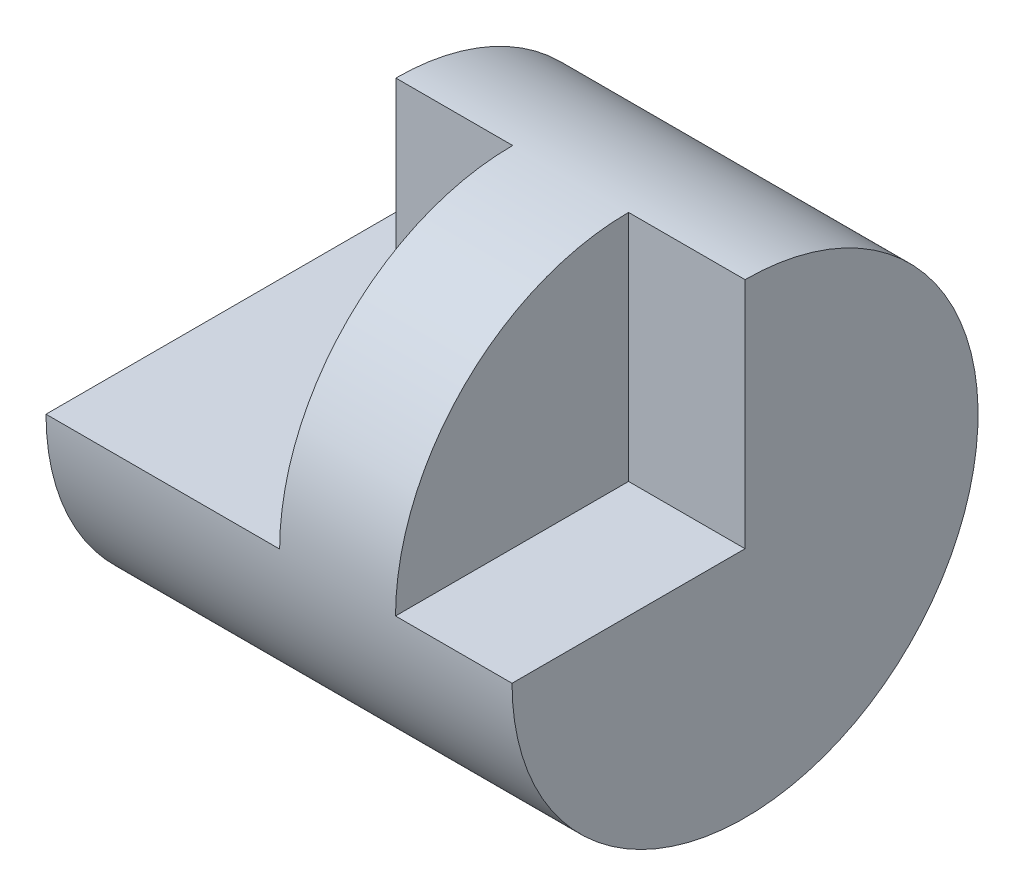
ISO-10303-21;
HEADER;
FILE_DESCRIPTION(('STEP AP214'),'2;1');
FILE_NAME('part.step','',(''),(''),'','','');
FILE_SCHEMA(('AUTOMOTIVE_DESIGN { 1 0 10303 214 1 1 1 1 }'));
ENDSEC;
DATA;
#1=APPLICATION_CONTEXT('core data for automotive mechanical design processes');
#2=APPLICATION_PROTOCOL_DEFINITION('international standard','automotive_design',2000,#1);
#3=PRODUCT_CONTEXT('',#1,'mechanical');
#4=PRODUCT('Part','Part','',(#3));
#5=PRODUCT_RELATED_PRODUCT_CATEGORY('part','',(#4));
#6=PRODUCT_DEFINITION_FORMATION('','',#4);
#7=PRODUCT_DEFINITION_CONTEXT('part definition',#1,'design');
#8=PRODUCT_DEFINITION('design','',#6,#7);
#9=PRODUCT_DEFINITION_SHAPE('','',#8);
#10=(LENGTH_UNIT() NAMED_UNIT(*) SI_UNIT(.MILLI.,.METRE.));
#11=(NAMED_UNIT(*) PLANE_ANGLE_UNIT() SI_UNIT($,.RADIAN.));
#12=(NAMED_UNIT(*) SI_UNIT($,.STERADIAN.) SOLID_ANGLE_UNIT());
#13=UNCERTAINTY_MEASURE_WITH_UNIT(LENGTH_MEASURE(1.E-05),#10,'distance_accuracy_value','');
#14=(GEOMETRIC_REPRESENTATION_CONTEXT(3) GLOBAL_UNCERTAINTY_ASSIGNED_CONTEXT((#13)) GLOBAL_UNIT_ASSIGNED_CONTEXT((#10,
#11,#12)) REPRESENTATION_CONTEXT('',''));
#15=CARTESIAN_POINT('',(0.,0.,0.));
#16=DIRECTION('',(0.,0.,1.));
#17=DIRECTION('',(1.,0.,0.));
#18=AXIS2_PLACEMENT_3D('',#15,#16,#17);
#19=CARTESIAN_POINT('',(0.,0.,0.));
#20=DIRECTION('',(-1.,0.,0.));
#21=DIRECTION('',(0.,0.,1.));
#22=AXIS2_PLACEMENT_3D('',#19,#20,#21);
#23=CYLINDRICAL_SURFACE('',#22,2.);
#24=CARTESIAN_POINT('',(1.00269054531971,0.,0.));
#25=DIRECTION('',(1.,0.,0.));
#26=DIRECTION('',(0.,0.,-1.));
#27=AXIS2_PLACEMENT_3D('',#24,#25,#26);
#28=CIRCLE('',#27,2.);
#29=CARTESIAN_POINT('',(1.00269054531971,2.,0.));
#30=VERTEX_POINT('',#29);
#31=CARTESIAN_POINT('',(1.00269054531971,0.,-2.));
#32=VERTEX_POINT('',#31);
#33=EDGE_CURVE('E96',#30,#32,#28,.F.);
#34=ORIENTED_EDGE('',*,*,#33,.F.);
#35=DIRECTION('',(1.,0.,0.));
#36=VECTOR('',#35,1.);
#37=CARTESIAN_POINT('',(0.,2.,0.));
#38=LINE('',#37,#36);
#39=CARTESIAN_POINT('',(2.00538109063942,2.,0.));
#40=VERTEX_POINT('',#39);
#41=EDGE_CURVE('E109',#30,#40,#38,.T.);
#42=ORIENTED_EDGE('',*,*,#41,.T.);
#43=CARTESIAN_POINT('',(2.00538109063942,0.,0.));
#44=DIRECTION('',(-1.,0.,0.));
#45=DIRECTION('',(0.,-1.,0.));
#46=AXIS2_PLACEMENT_3D('',#43,#44,#45);
#47=CIRCLE('',#46,2.);
#48=CARTESIAN_POINT('',(2.00538109063942,0.,2.));
#49=VERTEX_POINT('',#48);
#50=EDGE_CURVE('E11',#40,#49,#47,.F.);
#51=ORIENTED_EDGE('',*,*,#50,.T.);
#52=DIRECTION('',(-1.,0.,0.));
#53=VECTOR('',#52,1.);
#54=CARTESIAN_POINT('',(0.,0.,2.));
#55=LINE('',#54,#53);
#56=CARTESIAN_POINT('',(0.,0.,2.));
#57=VERTEX_POINT('',#56);
#58=EDGE_CURVE('E115',#49,#57,#55,.T.);
#59=ORIENTED_EDGE('',*,*,#58,.T.);
#60=CARTESIAN_POINT('',(0.,0.,0.));
#61=DIRECTION('',(-1.,0.,0.));
#62=DIRECTION('',(0.,0.,1.));
#63=AXIS2_PLACEMENT_3D('',#60,#61,#62);
#64=CIRCLE('',#63,2.);
#65=CARTESIAN_POINT('',(0.,0.,-2.));
#66=VERTEX_POINT('',#65);
#67=EDGE_CURVE('E139',#66,#57,#64,.T.);
#68=ORIENTED_EDGE('',*,*,#67,.F.);
#69=DIRECTION('',(-1.,0.,0.));
#70=VECTOR('',#69,1.);
#71=CARTESIAN_POINT('',(0.,0.,-2.));
#72=LINE('',#71,#70);
#73=EDGE_CURVE('E101',#32,#66,#72,.T.);
#74=ORIENTED_EDGE('',*,*,#73,.F.);
#75=EDGE_LOOP('',(#34,#42,#51,#59,#68,#74));
#76=FACE_BOUND('',#75,.T.);
#77=DIRECTION('',(-1.,0.,0.));
#78=VECTOR('',#77,1.);
#79=CARTESIAN_POINT('',(0.,0.,2.));
#80=LINE('',#79,#78);
#81=CARTESIAN_POINT('',(3.,0.,2.));
#82=VERTEX_POINT('',#81);
#83=CARTESIAN_POINT('',(4.,0.,2.));
#84=VERTEX_POINT('',#83);
#85=EDGE_CURVE('E134',#82,#84,#80,.F.);
#86=ORIENTED_EDGE('',*,*,#85,.F.);
#87=CARTESIAN_POINT('',(3.,0.,0.));
#88=DIRECTION('',(1.,0.,0.));
#89=DIRECTION('',(0.,1.,0.));
#90=AXIS2_PLACEMENT_3D('',#87,#88,#89);
#91=CIRCLE('',#90,2.);
#92=CARTESIAN_POINT('',(3.,2.,0.));
#93=VERTEX_POINT('',#92);
#94=EDGE_CURVE('E55',#82,#93,#91,.F.);
#95=ORIENTED_EDGE('',*,*,#94,.T.);
#96=DIRECTION('',(-1.,0.,0.));
#97=VECTOR('',#96,1.);
#98=CARTESIAN_POINT('',(0.,2.,0.));
#99=LINE('',#98,#97);
#100=CARTESIAN_POINT('',(4.,2.,0.));
#101=VERTEX_POINT('',#100);
#102=EDGE_CURVE('E118',#101,#93,#99,.T.);
#103=ORIENTED_EDGE('',*,*,#102,.F.);
#104=CARTESIAN_POINT('',(4.,0.,0.));
#105=DIRECTION('',(-1.,0.,0.));
#106=DIRECTION('',(0.,0.,1.));
#107=AXIS2_PLACEMENT_3D('',#104,#105,#106);
#108=CIRCLE('',#107,2.);
#109=EDGE_CURVE('E136',#101,#84,#108,.T.);
#110=ORIENTED_EDGE('',*,*,#109,.T.);
#111=EDGE_LOOP('',(#86,#95,#103,#110));
#112=FACE_BOUND('',#111,.T.);
#113=ADVANCED_FACE('F33',(#76,#112),#23,.T.);
#114=CARTESIAN_POINT('',(0.,-2.,0.));
#115=DIRECTION('',(1.,0.,0.));
#116=DIRECTION('',(0.,0.,-1.));
#117=AXIS2_PLACEMENT_3D('',#114,#115,#116);
#118=PLANE('',#117);
#119=DIRECTION('',(0.,0.,1.));
#120=VECTOR('',#119,1.);
#121=CARTESIAN_POINT('',(0.,0.,0.));
#122=LINE('',#121,#120);
#123=EDGE_CURVE('E40',#66,#57,#122,.T.);
#124=ORIENTED_EDGE('',*,*,#123,.F.);
#125=ORIENTED_EDGE('',*,*,#67,.T.);
#126=EDGE_LOOP('',(#124,#125));
#127=FACE_BOUND('',#126,.T.);
#128=ADVANCED_FACE('F164',(#127),#118,.F.);
#129=CARTESIAN_POINT('',(4.,0.,0.));
#130=DIRECTION('',(-1.,0.,0.));
#131=DIRECTION('',(0.,0.,1.));
#132=AXIS2_PLACEMENT_3D('',#129,#130,#131);
#133=PLANE('',#132);
#134=DIRECTION('',(0.,-1.,0.));
#135=VECTOR('',#134,1.);
#136=CARTESIAN_POINT('',(4.,0.,0.));
#137=LINE('',#136,#135);
#138=CARTESIAN_POINT('',(4.,0.,0.));
#139=VERTEX_POINT('',#138);
#140=EDGE_CURVE('E129',#101,#139,#137,.T.);
#141=ORIENTED_EDGE('',*,*,#140,.T.);
#142=DIRECTION('',(0.,0.,1.));
#143=VECTOR('',#142,1.);
#144=CARTESIAN_POINT('',(4.,0.,0.));
#145=LINE('',#144,#143);
#146=EDGE_CURVE('E141',#139,#84,#145,.T.);
#147=ORIENTED_EDGE('',*,*,#146,.T.);
#148=ORIENTED_EDGE('',*,*,#109,.F.);
#149=EDGE_LOOP('',(#141,#147,#148));
#150=FACE_BOUND('',#149,.T.);
#151=ADVANCED_FACE('F168',(#150),#133,.F.);
#152=CARTESIAN_POINT('',(3.,0.,11.));
#153=DIRECTION('',(1.,0.,0.));
#154=DIRECTION('',(0.,1.,0.));
#155=AXIS2_PLACEMENT_3D('',#152,#153,#154);
#156=PLANE('',#155);
#157=DIRECTION('',(0.,0.,-1.));
#158=VECTOR('',#157,1.);
#159=CARTESIAN_POINT('',(3.,0.,11.));
#160=LINE('',#159,#158);
#161=CARTESIAN_POINT('',(3.,0.,0.));
#162=VERTEX_POINT('',#161);
#163=EDGE_CURVE('E132',#82,#162,#160,.T.);
#164=ORIENTED_EDGE('',*,*,#163,.T.);
#165=DIRECTION('',(0.,-1.,0.));
#166=VECTOR('',#165,1.);
#167=CARTESIAN_POINT('',(3.,0.,0.));
#168=LINE('',#167,#166);
#169=EDGE_CURVE('E126',#93,#162,#168,.T.);
#170=ORIENTED_EDGE('',*,*,#169,.F.);
#171=ORIENTED_EDGE('',*,*,#94,.F.);
#172=EDGE_LOOP('',(#164,#170,#171));
#173=FACE_BOUND('',#172,.T.);
#174=ADVANCED_FACE('F172',(#173),#156,.T.);
#175=CARTESIAN_POINT('',(0.,0.,11.));
#176=DIRECTION('',(0.,-1.,0.));
#177=DIRECTION('',(1.,0.,0.));
#178=AXIS2_PLACEMENT_3D('',#175,#176,#177);
#179=PLANE('',#178);
#180=ORIENTED_EDGE('',*,*,#85,.T.);
#181=ORIENTED_EDGE('',*,*,#146,.F.);
#182=DIRECTION('',(-1.,0.,0.));
#183=VECTOR('',#182,1.);
#184=CARTESIAN_POINT('',(0.,0.,0.));
#185=LINE('',#184,#183);
#186=EDGE_CURVE('E47',#139,#162,#185,.T.);
#187=ORIENTED_EDGE('',*,*,#186,.T.);
#188=ORIENTED_EDGE('',*,*,#163,.F.);
#189=EDGE_LOOP('',(#180,#181,#187,#188));
#190=FACE_BOUND('',#189,.T.);
#191=ADVANCED_FACE('F178',(#190),#179,.F.);
#192=CARTESIAN_POINT('',(0.,0.,0.));
#193=DIRECTION('',(0.,0.,1.));
#194=DIRECTION('',(1.,0.,0.));
#195=AXIS2_PLACEMENT_3D('',#192,#193,#194);
#196=PLANE('',#195);
#197=ORIENTED_EDGE('',*,*,#102,.T.);
#198=ORIENTED_EDGE('',*,*,#169,.T.);
#199=ORIENTED_EDGE('',*,*,#186,.F.);
#200=ORIENTED_EDGE('',*,*,#140,.F.);
#201=EDGE_LOOP('',(#197,#198,#199,#200));
#202=FACE_BOUND('',#201,.T.);
#203=ADVANCED_FACE('F181',(#202),#196,.T.);
#204=CARTESIAN_POINT('',(0.,0.,11.));
#205=DIRECTION('',(0.,1.,0.));
#206=DIRECTION('',(-1.,0.,0.));
#207=AXIS2_PLACEMENT_3D('',#204,#205,#206);
#208=PLANE('',#207);
#209=ORIENTED_EDGE('',*,*,#58,.F.);
#210=DIRECTION('',(0.,0.,-1.));
#211=VECTOR('',#210,1.);
#212=CARTESIAN_POINT('',(2.00538109063942,0.,0.));
#213=LINE('',#212,#211);
#214=CARTESIAN_POINT('',(2.00538109063942,0.,0.));
#215=VERTEX_POINT('',#214);
#216=EDGE_CURVE('E114',#49,#215,#213,.T.);
#217=ORIENTED_EDGE('',*,*,#216,.T.);
#218=DIRECTION('',(1.,0.,0.));
#219=VECTOR('',#218,1.);
#220=CARTESIAN_POINT('',(0.,0.,0.));
#221=LINE('',#220,#219);
#222=CARTESIAN_POINT('',(1.00269054531971,0.,0.));
#223=VERTEX_POINT('',#222);
#224=EDGE_CURVE('E107',#223,#215,#221,.T.);
#225=ORIENTED_EDGE('',*,*,#224,.F.);
#226=DIRECTION('',(0.,0.,1.));
#227=VECTOR('',#226,1.);
#228=CARTESIAN_POINT('',(1.00269054531971,0.,-10.));
#229=LINE('',#228,#227);
#230=EDGE_CURVE('E91',#32,#223,#229,.T.);
#231=ORIENTED_EDGE('',*,*,#230,.F.);
#232=ORIENTED_EDGE('',*,*,#73,.T.);
#233=ORIENTED_EDGE('',*,*,#123,.T.);
#234=EDGE_LOOP('',(#209,#217,#225,#231,#232,#233));
#235=FACE_BOUND('',#234,.T.);
#236=ADVANCED_FACE('F112',(#235),#208,.T.);
#237=CARTESIAN_POINT('',(0.,0.,0.));
#238=DIRECTION('',(0.,0.,1.));
#239=DIRECTION('',(1.,0.,0.));
#240=AXIS2_PLACEMENT_3D('',#237,#238,#239);
#241=PLANE('',#240);
#242=DIRECTION('',(0.,1.,0.));
#243=VECTOR('',#242,1.);
#244=CARTESIAN_POINT('',(1.00269054531971,2.,0.));
#245=LINE('',#244,#243);
#246=EDGE_CURVE('E94',#223,#30,#245,.T.);
#247=ORIENTED_EDGE('',*,*,#246,.F.);
#248=ORIENTED_EDGE('',*,*,#224,.T.);
#249=DIRECTION('',(0.,-1.,0.));
#250=VECTOR('',#249,1.);
#251=CARTESIAN_POINT('',(2.00538109063942,3.,0.));
#252=LINE('',#251,#250);
#253=EDGE_CURVE('E120',#40,#215,#252,.T.);
#254=ORIENTED_EDGE('',*,*,#253,.F.);
#255=ORIENTED_EDGE('',*,*,#41,.F.);
#256=EDGE_LOOP('',(#247,#248,#254,#255));
#257=FACE_BOUND('',#256,.T.);
#258=ADVANCED_FACE('F105',(#257),#241,.T.);
#259=CARTESIAN_POINT('',(2.00538109063942,3.,0.));
#260=DIRECTION('',(-1.,0.,0.));
#261=DIRECTION('',(0.,-1.,0.));
#262=AXIS2_PLACEMENT_3D('',#259,#260,#261);
#263=PLANE('',#262);
#264=ORIENTED_EDGE('',*,*,#253,.T.);
#265=ORIENTED_EDGE('',*,*,#216,.F.);
#266=ORIENTED_EDGE('',*,*,#50,.F.);
#267=EDGE_LOOP('',(#264,#265,#266));
#268=FACE_BOUND('',#267,.T.);
#269=ADVANCED_FACE('F151',(#268),#263,.T.);
#270=CARTESIAN_POINT('',(1.00269054531971,2.,-10.));
#271=DIRECTION('',(1.,0.,0.));
#272=DIRECTION('',(0.,0.,-1.));
#273=AXIS2_PLACEMENT_3D('',#270,#271,#272);
#274=PLANE('',#273);
#275=ORIENTED_EDGE('',*,*,#33,.T.);
#276=ORIENTED_EDGE('',*,*,#230,.T.);
#277=ORIENTED_EDGE('',*,*,#246,.T.);
#278=EDGE_LOOP('',(#275,#276,#277));
#279=FACE_BOUND('',#278,.T.);
#280=ADVANCED_FACE('F93',(#279),#274,.F.);
#281=CLOSED_SHELL('',(#113,#128,#151,#174,#191,#203,#236,#258,#269,#280));
#282=MANIFOLD_SOLID_BREP('B2',#281);
#283=ADVANCED_BREP_SHAPE_REPRESENTATION('',(#18,#282),#14);
#284=SHAPE_DEFINITION_REPRESENTATION(#9,#283);
ENDSEC;
END-ISO-10303-21;
